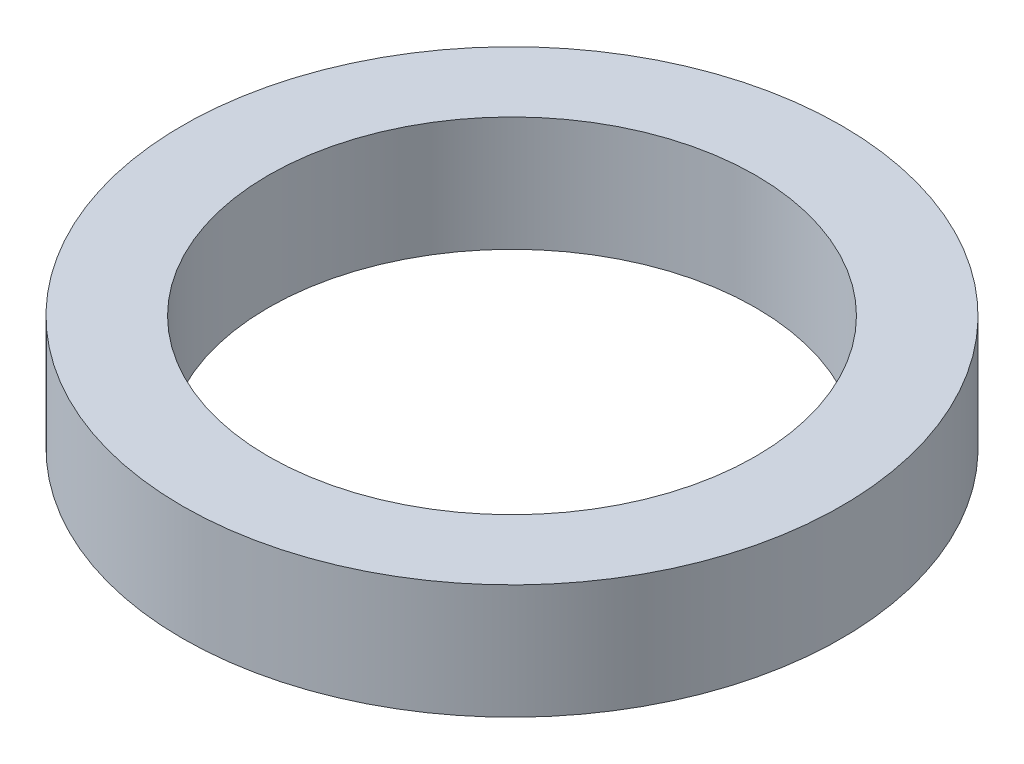
ISO-10303-21;
HEADER;
FILE_DESCRIPTION(('STEP AP214'),'2;1');
FILE_NAME('part.step','',(''),(''),'','','');
FILE_SCHEMA(('AUTOMOTIVE_DESIGN { 1 0 10303 214 1 1 1 1 }'));
ENDSEC;
DATA;
#1=APPLICATION_CONTEXT('core data for automotive mechanical design processes');
#2=APPLICATION_PROTOCOL_DEFINITION('international standard','automotive_design',2000,#1);
#3=PRODUCT_CONTEXT('',#1,'mechanical');
#4=PRODUCT('Part','Part','',(#3));
#5=PRODUCT_RELATED_PRODUCT_CATEGORY('part','',(#4));
#6=PRODUCT_DEFINITION_FORMATION('','',#4);
#7=PRODUCT_DEFINITION_CONTEXT('part definition',#1,'design');
#8=PRODUCT_DEFINITION('design','',#6,#7);
#9=PRODUCT_DEFINITION_SHAPE('','',#8);
#10=(LENGTH_UNIT() NAMED_UNIT(*) SI_UNIT(.MILLI.,.METRE.));
#11=(NAMED_UNIT(*) PLANE_ANGLE_UNIT() SI_UNIT($,.RADIAN.));
#12=(NAMED_UNIT(*) SI_UNIT($,.STERADIAN.) SOLID_ANGLE_UNIT());
#13=UNCERTAINTY_MEASURE_WITH_UNIT(LENGTH_MEASURE(1.E-05),#10,'distance_accuracy_value','');
#14=(GEOMETRIC_REPRESENTATION_CONTEXT(3) GLOBAL_UNCERTAINTY_ASSIGNED_CONTEXT((#13)) GLOBAL_UNIT_ASSIGNED_CONTEXT((#10,
#11,#12)) REPRESENTATION_CONTEXT('',''));
#15=CARTESIAN_POINT('',(0.,0.,0.));
#16=DIRECTION('',(0.,0.,1.));
#17=DIRECTION('',(1.,0.,0.));
#18=AXIS2_PLACEMENT_3D('',#15,#16,#17);
#19=CARTESIAN_POINT('',(0.,20.,0.));
#20=DIRECTION('',(0.,-1.,0.));
#21=DIRECTION('',(0.,0.,-1.));
#22=AXIS2_PLACEMENT_3D('',#19,#20,#21);
#23=CYLINDRICAL_SURFACE('',#22,57.5);
#24=CARTESIAN_POINT('',(0.,20.,0.));
#25=DIRECTION('',(0.,1.,0.));
#26=DIRECTION('',(0.,0.,1.));
#27=AXIS2_PLACEMENT_3D('',#24,#25,#26);
#28=CIRCLE('',#27,57.5);
#29=CARTESIAN_POINT('',(0.,20.,57.5));
#30=VERTEX_POINT('',#29);
#31=EDGE_CURVE('E10',#30,#30,#28,.T.);
#32=ORIENTED_EDGE('',*,*,#31,.F.);
#33=EDGE_LOOP('',(#32));
#34=FACE_BOUND('',#33,.T.);
#35=CARTESIAN_POINT('',(0.,0.,0.));
#36=DIRECTION('',(0.,1.,0.));
#37=DIRECTION('',(0.,0.,1.));
#38=AXIS2_PLACEMENT_3D('',#35,#36,#37);
#39=CIRCLE('',#38,57.5);
#40=CARTESIAN_POINT('',(0.,0.,57.5));
#41=VERTEX_POINT('',#40);
#42=EDGE_CURVE('E37',#41,#41,#39,.T.);
#43=ORIENTED_EDGE('',*,*,#42,.T.);
#44=EDGE_LOOP('',(#43));
#45=FACE_BOUND('',#44,.T.);
#46=ADVANCED_FACE('F40',(#34,#45),#23,.T.);
#47=CARTESIAN_POINT('',(0.,20.,0.));
#48=DIRECTION('',(0.,1.,0.));
#49=DIRECTION('',(0.,0.,1.));
#50=AXIS2_PLACEMENT_3D('',#47,#48,#49);
#51=PLANE('',#50);
#52=CARTESIAN_POINT('',(0.,20.,0.));
#53=DIRECTION('',(0.,1.,0.));
#54=DIRECTION('',(0.,0.,1.));
#55=AXIS2_PLACEMENT_3D('',#52,#53,#54);
#56=CIRCLE('',#55,42.5);
#57=CARTESIAN_POINT('',(0.,20.,42.5));
#58=VERTEX_POINT('',#57);
#59=EDGE_CURVE('E50',#58,#58,#56,.T.);
#60=ORIENTED_EDGE('',*,*,#59,.F.);
#61=EDGE_LOOP('',(#60));
#62=FACE_BOUND('',#61,.T.);
#63=ORIENTED_EDGE('',*,*,#31,.T.);
#64=EDGE_LOOP('',(#63));
#65=FACE_BOUND('',#64,.T.);
#66=ADVANCED_FACE('F59',(#62,#65),#51,.T.);
#67=CARTESIAN_POINT('',(0.,0.,0.));
#68=DIRECTION('',(0.,1.,0.));
#69=DIRECTION('',(0.,0.,1.));
#70=AXIS2_PLACEMENT_3D('',#67,#68,#69);
#71=PLANE('',#70);
#72=CARTESIAN_POINT('',(0.,0.,0.));
#73=DIRECTION('',(0.,1.,0.));
#74=DIRECTION('',(0.,0.,1.));
#75=AXIS2_PLACEMENT_3D('',#72,#73,#74);
#76=CIRCLE('',#75,42.5);
#77=CARTESIAN_POINT('',(0.,0.,42.5));
#78=VERTEX_POINT('',#77);
#79=EDGE_CURVE('E47',#78,#78,#76,.T.);
#80=ORIENTED_EDGE('',*,*,#79,.T.);
#81=EDGE_LOOP('',(#80));
#82=FACE_BOUND('',#81,.T.);
#83=ORIENTED_EDGE('',*,*,#42,.F.);
#84=EDGE_LOOP('',(#83));
#85=FACE_BOUND('',#84,.T.);
#86=ADVANCED_FACE('F58',(#82,#85),#71,.F.);
#87=CARTESIAN_POINT('',(0.,20.,0.));
#88=DIRECTION('',(0.,-1.,0.));
#89=DIRECTION('',(0.,0.,-1.));
#90=AXIS2_PLACEMENT_3D('',#87,#88,#89);
#91=CYLINDRICAL_SURFACE('',#90,42.5);
#92=ORIENTED_EDGE('',*,*,#59,.T.);
#93=EDGE_LOOP('',(#92));
#94=FACE_BOUND('',#93,.T.);
#95=ORIENTED_EDGE('',*,*,#79,.F.);
#96=EDGE_LOOP('',(#95));
#97=FACE_BOUND('',#96,.T.);
#98=ADVANCED_FACE('F54',(#94,#97),#91,.F.);
#99=CLOSED_SHELL('',(#46,#66,#86,#98));
#100=MANIFOLD_SOLID_BREP('B2',#99);
#101=ADVANCED_BREP_SHAPE_REPRESENTATION('',(#18,#100),#14);
#102=SHAPE_DEFINITION_REPRESENTATION(#9,#101);
ENDSEC;
END-ISO-10303-21;
